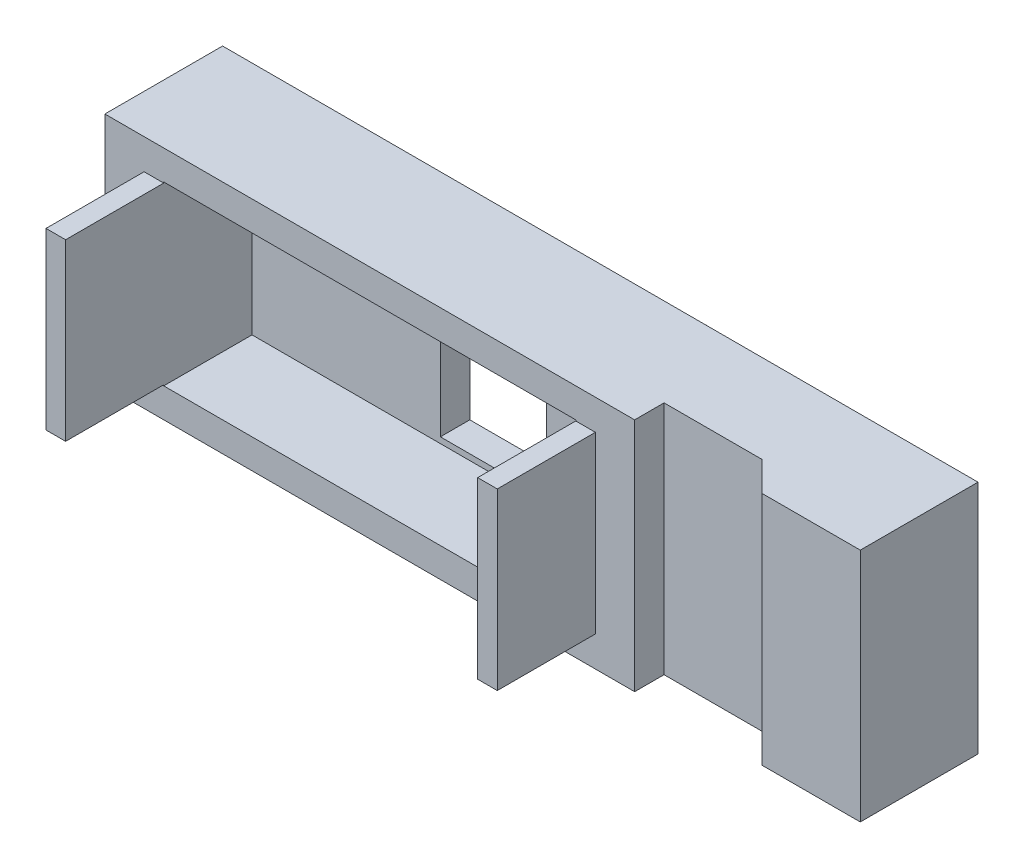
ISO-10303-21;
HEADER;
FILE_DESCRIPTION(('STEP AP214'),'2;1');
FILE_NAME('part.step','',(''),(''),'','','');
FILE_SCHEMA(('AUTOMOTIVE_DESIGN { 1 0 10303 214 1 1 1 1 }'));
ENDSEC;
DATA;
#1=APPLICATION_CONTEXT('core data for automotive mechanical design processes');
#2=APPLICATION_PROTOCOL_DEFINITION('international standard','automotive_design',2000,#1);
#3=PRODUCT_CONTEXT('',#1,'mechanical');
#4=PRODUCT('Part','Part','',(#3));
#5=PRODUCT_RELATED_PRODUCT_CATEGORY('part','',(#4));
#6=PRODUCT_DEFINITION_FORMATION('','',#4);
#7=PRODUCT_DEFINITION_CONTEXT('part definition',#1,'design');
#8=PRODUCT_DEFINITION('design','',#6,#7);
#9=PRODUCT_DEFINITION_SHAPE('','',#8);
#10=(LENGTH_UNIT() NAMED_UNIT(*) SI_UNIT(.MILLI.,.METRE.));
#11=(NAMED_UNIT(*) PLANE_ANGLE_UNIT() SI_UNIT($,.RADIAN.));
#12=(NAMED_UNIT(*) SI_UNIT($,.STERADIAN.) SOLID_ANGLE_UNIT());
#13=UNCERTAINTY_MEASURE_WITH_UNIT(LENGTH_MEASURE(1.E-05),#10,'distance_accuracy_value','');
#14=(GEOMETRIC_REPRESENTATION_CONTEXT(3) GLOBAL_UNCERTAINTY_ASSIGNED_CONTEXT((#13)) GLOBAL_UNIT_ASSIGNED_CONTEXT((#10,
#11,#12)) REPRESENTATION_CONTEXT('',''));
#15=CARTESIAN_POINT('',(0.,0.,0.));
#16=DIRECTION('',(0.,0.,1.));
#17=DIRECTION('',(1.,0.,0.));
#18=AXIS2_PLACEMENT_3D('',#15,#16,#17);
#19=CARTESIAN_POINT('',(0.,0.,6.));
#20=DIRECTION('',(0.,0.,1.));
#21=DIRECTION('',(1.,0.,0.));
#22=AXIS2_PLACEMENT_3D('',#19,#20,#21);
#23=PLANE('',#22);
#24=DIRECTION('',(0.,1.,0.));
#25=VECTOR('',#24,1.);
#26=CARTESIAN_POINT('',(13.5,6.,6.));
#27=LINE('',#26,#25);
#28=CARTESIAN_POINT('',(13.5,-6.,6.));
#29=VERTEX_POINT('',#28);
#30=CARTESIAN_POINT('',(13.5,6.,6.));
#31=VERTEX_POINT('',#30);
#32=EDGE_CURVE('E360',#29,#31,#27,.T.);
#33=ORIENTED_EDGE('',*,*,#32,.T.);
#34=DIRECTION('',(-1.,0.,0.));
#35=VECTOR('',#34,1.);
#36=CARTESIAN_POINT('',(-13.5,6.,6.));
#37=LINE('',#36,#35);
#38=CARTESIAN_POINT('',(-13.5,6.,6.));
#39=VERTEX_POINT('',#38);
#40=EDGE_CURVE('E363',#31,#39,#37,.T.);
#41=ORIENTED_EDGE('',*,*,#40,.T.);
#42=DIRECTION('',(0.,-1.,0.));
#43=VECTOR('',#42,1.);
#44=CARTESIAN_POINT('',(-13.5,6.,6.));
#45=LINE('',#44,#43);
#46=CARTESIAN_POINT('',(-13.5,-6.,6.));
#47=VERTEX_POINT('',#46);
#48=EDGE_CURVE('E366',#39,#47,#45,.T.);
#49=ORIENTED_EDGE('',*,*,#48,.T.);
#50=DIRECTION('',(1.,0.,0.));
#51=VECTOR('',#50,1.);
#52=CARTESIAN_POINT('',(-13.5,-6.,6.));
#53=LINE('',#52,#51);
#54=EDGE_CURVE('E368',#47,#29,#53,.T.);
#55=ORIENTED_EDGE('',*,*,#54,.T.);
#56=EDGE_LOOP('',(#33,#41,#49,#55));
#57=FACE_BOUND('',#56,.T.);
#58=DIRECTION('',(0.,1.,0.));
#59=VECTOR('',#58,1.);
#60=CARTESIAN_POINT('',(11.5,4.45,6.));
#61=LINE('',#60,#59);
#62=CARTESIAN_POINT('',(11.5,-4.45,6.));
#63=VERTEX_POINT('',#62);
#64=CARTESIAN_POINT('',(11.5,4.45,6.));
#65=VERTEX_POINT('',#64);
#66=EDGE_CURVE('E250',#63,#65,#61,.T.);
#67=ORIENTED_EDGE('',*,*,#66,.F.);
#68=DIRECTION('',(1.,0.,0.));
#69=VECTOR('',#68,1.);
#70=CARTESIAN_POINT('',(10.5,-4.45,6.));
#71=LINE('',#70,#69);
#72=CARTESIAN_POINT('',(10.5,-4.45,6.));
#73=VERTEX_POINT('',#72);
#74=EDGE_CURVE('E237',#73,#63,#71,.T.);
#75=ORIENTED_EDGE('',*,*,#74,.F.);
#76=DIRECTION('',(0.,1.,0.));
#77=VECTOR('',#76,1.);
#78=CARTESIAN_POINT('',(10.5,4.5,6.));
#79=LINE('',#78,#77);
#80=CARTESIAN_POINT('',(10.5,-4.5,6.));
#81=VERTEX_POINT('',#80);
#82=EDGE_CURVE('E336',#81,#73,#79,.T.);
#83=ORIENTED_EDGE('',*,*,#82,.F.);
#84=DIRECTION('',(1.,0.,0.));
#85=VECTOR('',#84,1.);
#86=CARTESIAN_POINT('',(-10.5,-4.5,6.));
#87=LINE('',#86,#85);
#88=CARTESIAN_POINT('',(-10.5,-4.5,6.));
#89=VERTEX_POINT('',#88);
#90=EDGE_CURVE('E345',#89,#81,#87,.T.);
#91=ORIENTED_EDGE('',*,*,#90,.F.);
#92=DIRECTION('',(0.,-1.,0.));
#93=VECTOR('',#92,1.);
#94=CARTESIAN_POINT('',(-10.5,4.5,6.));
#95=LINE('',#94,#93);
#96=CARTESIAN_POINT('',(-10.5,-4.45,6.));
#97=VERTEX_POINT('',#96);
#98=EDGE_CURVE('E341',#97,#89,#95,.T.);
#99=ORIENTED_EDGE('',*,*,#98,.F.);
#100=DIRECTION('',(1.,0.,0.));
#101=VECTOR('',#100,1.);
#102=CARTESIAN_POINT('',(-10.5,-4.45,6.));
#103=LINE('',#102,#101);
#104=CARTESIAN_POINT('',(-11.5,-4.45,6.));
#105=VERTEX_POINT('',#104);
#106=EDGE_CURVE('E266',#105,#97,#103,.T.);
#107=ORIENTED_EDGE('',*,*,#106,.F.);
#108=DIRECTION('',(0.,-1.,0.));
#109=VECTOR('',#108,1.);
#110=CARTESIAN_POINT('',(-11.5,4.45,6.));
#111=LINE('',#110,#109);
#112=CARTESIAN_POINT('',(-11.5,4.45,6.));
#113=VERTEX_POINT('',#112);
#114=EDGE_CURVE('E275',#113,#105,#111,.T.);
#115=ORIENTED_EDGE('',*,*,#114,.F.);
#116=DIRECTION('',(-1.,0.,0.));
#117=VECTOR('',#116,1.);
#118=CARTESIAN_POINT('',(-10.5,4.45,6.));
#119=LINE('',#118,#117);
#120=CARTESIAN_POINT('',(-10.5,4.45,6.));
#121=VERTEX_POINT('',#120);
#122=EDGE_CURVE('E261',#121,#113,#119,.T.);
#123=ORIENTED_EDGE('',*,*,#122,.F.);
#124=CARTESIAN_POINT('',(-10.5,4.5,6.));
#125=VERTEX_POINT('',#124);
#126=EDGE_CURVE('E342',#125,#121,#95,.T.);
#127=ORIENTED_EDGE('',*,*,#126,.F.);
#128=DIRECTION('',(-1.,0.,0.));
#129=VECTOR('',#128,1.);
#130=CARTESIAN_POINT('',(-10.5,4.5,6.));
#131=LINE('',#130,#129);
#132=CARTESIAN_POINT('',(10.5,4.5,6.));
#133=VERTEX_POINT('',#132);
#134=EDGE_CURVE('E339',#133,#125,#131,.T.);
#135=ORIENTED_EDGE('',*,*,#134,.F.);
#136=CARTESIAN_POINT('',(10.5,4.45,6.));
#137=VERTEX_POINT('',#136);
#138=EDGE_CURVE('E335',#137,#133,#79,.T.);
#139=ORIENTED_EDGE('',*,*,#138,.F.);
#140=DIRECTION('',(-1.,0.,0.));
#141=VECTOR('',#140,1.);
#142=CARTESIAN_POINT('',(10.5,4.45,6.));
#143=LINE('',#142,#141);
#144=EDGE_CURVE('E242',#65,#137,#143,.T.);
#145=ORIENTED_EDGE('',*,*,#144,.F.);
#146=EDGE_LOOP('',(#67,#75,#83,#91,#99,#107,#115,#123,#127,#135,#139,#145));
#147=FACE_BOUND('',#146,.T.);
#148=ADVANCED_FACE('F33',(#57,#147),#23,.T.);
#149=CARTESIAN_POINT('',(10.5,4.5,6.));
#150=DIRECTION('',(-1.,0.,0.));
#151=DIRECTION('',(0.,0.,1.));
#152=AXIS2_PLACEMENT_3D('',#149,#150,#151);
#153=PLANE('',#152);
#154=DIRECTION('',(0.,0.,-1.));
#155=VECTOR('',#154,1.);
#156=CARTESIAN_POINT('',(10.5,4.5,6.));
#157=LINE('',#156,#155);
#158=CARTESIAN_POINT('',(10.5,4.5,1.5));
#159=VERTEX_POINT('',#158);
#160=EDGE_CURVE('E356',#133,#159,#157,.T.);
#161=ORIENTED_EDGE('',*,*,#160,.T.);
#162=DIRECTION('',(0.,-1.,0.));
#163=VECTOR('',#162,1.);
#164=CARTESIAN_POINT('',(10.5,4.5,1.5));
#165=LINE('',#164,#163);
#166=CARTESIAN_POINT('',(10.5,-4.5,1.5));
#167=VERTEX_POINT('',#166);
#168=EDGE_CURVE('E317',#159,#167,#165,.T.);
#169=ORIENTED_EDGE('',*,*,#168,.T.);
#170=DIRECTION('',(0.,0.,-1.));
#171=VECTOR('',#170,1.);
#172=CARTESIAN_POINT('',(10.5,-4.5,6.));
#173=LINE('',#172,#171);
#174=EDGE_CURVE('E347',#81,#167,#173,.T.);
#175=ORIENTED_EDGE('',*,*,#174,.F.);
#176=ORIENTED_EDGE('',*,*,#82,.T.);
#177=DIRECTION('',(0.,0.,-1.));
#178=VECTOR('',#177,1.);
#179=CARTESIAN_POINT('',(10.5,-4.45,11.));
#180=LINE('',#179,#178);
#181=CARTESIAN_POINT('',(10.5,-4.45,11.));
#182=VERTEX_POINT('',#181);
#183=EDGE_CURVE('E259',#182,#73,#180,.T.);
#184=ORIENTED_EDGE('',*,*,#183,.F.);
#185=DIRECTION('',(0.,-1.,0.));
#186=VECTOR('',#185,1.);
#187=CARTESIAN_POINT('',(10.5,4.45,11.));
#188=LINE('',#187,#186);
#189=CARTESIAN_POINT('',(10.5,4.45,11.));
#190=VERTEX_POINT('',#189);
#191=EDGE_CURVE('E238',#190,#182,#188,.T.);
#192=ORIENTED_EDGE('',*,*,#191,.F.);
#193=DIRECTION('',(0.,0.,-1.));
#194=VECTOR('',#193,1.);
#195=CARTESIAN_POINT('',(10.5,4.45,11.));
#196=LINE('',#195,#194);
#197=EDGE_CURVE('E248',#190,#137,#196,.T.);
#198=ORIENTED_EDGE('',*,*,#197,.T.);
#199=ORIENTED_EDGE('',*,*,#138,.T.);
#200=EDGE_LOOP('',(#161,#169,#175,#176,#184,#192,#198,#199));
#201=FACE_BOUND('',#200,.T.);
#202=ADVANCED_FACE('F439',(#201),#153,.T.);
#203=CARTESIAN_POINT('',(-10.5,4.5,6.));
#204=DIRECTION('',(0.,-1.,0.));
#205=DIRECTION('',(0.,0.,-1.));
#206=AXIS2_PLACEMENT_3D('',#203,#204,#205);
#207=PLANE('',#206);
#208=DIRECTION('',(0.,0.,-1.));
#209=VECTOR('',#208,1.);
#210=CARTESIAN_POINT('',(-10.5,4.5,6.));
#211=LINE('',#210,#209);
#212=CARTESIAN_POINT('',(-10.5,4.5,1.5));
#213=VERTEX_POINT('',#212);
#214=EDGE_CURVE('E353',#125,#213,#211,.T.);
#215=ORIENTED_EDGE('',*,*,#214,.T.);
#216=DIRECTION('',(1.,0.,0.));
#217=VECTOR('',#216,1.);
#218=CARTESIAN_POINT('',(10.5,4.5,1.5));
#219=LINE('',#218,#217);
#220=EDGE_CURVE('E332',#213,#159,#219,.T.);
#221=ORIENTED_EDGE('',*,*,#220,.T.);
#222=ORIENTED_EDGE('',*,*,#160,.F.);
#223=ORIENTED_EDGE('',*,*,#134,.T.);
#224=EDGE_LOOP('',(#215,#221,#222,#223));
#225=FACE_BOUND('',#224,.T.);
#226=ADVANCED_FACE('F436',(#225),#207,.T.);
#227=CARTESIAN_POINT('',(-10.5,4.5,6.));
#228=DIRECTION('',(1.,0.,0.));
#229=DIRECTION('',(0.,0.,-1.));
#230=AXIS2_PLACEMENT_3D('',#227,#228,#229);
#231=PLANE('',#230);
#232=DIRECTION('',(0.,0.,-1.));
#233=VECTOR('',#232,1.);
#234=CARTESIAN_POINT('',(-10.5,-4.5,6.));
#235=LINE('',#234,#233);
#236=CARTESIAN_POINT('',(-10.5,-4.5,1.5));
#237=VERTEX_POINT('',#236);
#238=EDGE_CURVE('E350',#89,#237,#235,.T.);
#239=ORIENTED_EDGE('',*,*,#238,.T.);
#240=DIRECTION('',(0.,1.,0.));
#241=VECTOR('',#240,1.);
#242=CARTESIAN_POINT('',(-10.5,4.5,1.5));
#243=LINE('',#242,#241);
#244=EDGE_CURVE('E329',#237,#213,#243,.T.);
#245=ORIENTED_EDGE('',*,*,#244,.T.);
#246=ORIENTED_EDGE('',*,*,#214,.F.);
#247=ORIENTED_EDGE('',*,*,#126,.T.);
#248=DIRECTION('',(0.,0.,-1.));
#249=VECTOR('',#248,1.);
#250=CARTESIAN_POINT('',(-10.5,4.45,11.));
#251=LINE('',#250,#249);
#252=CARTESIAN_POINT('',(-10.5,4.45,11.));
#253=VERTEX_POINT('',#252);
#254=EDGE_CURVE('E288',#253,#121,#251,.T.);
#255=ORIENTED_EDGE('',*,*,#254,.F.);
#256=DIRECTION('',(0.,1.,0.));
#257=VECTOR('',#256,1.);
#258=CARTESIAN_POINT('',(-10.5,4.45,11.));
#259=LINE('',#258,#257);
#260=CARTESIAN_POINT('',(-10.5,-4.45,11.));
#261=VERTEX_POINT('',#260);
#262=EDGE_CURVE('E262',#261,#253,#259,.T.);
#263=ORIENTED_EDGE('',*,*,#262,.F.);
#264=DIRECTION('',(0.,0.,-1.));
#265=VECTOR('',#264,1.);
#266=CARTESIAN_POINT('',(-10.5,-4.45,11.));
#267=LINE('',#266,#265);
#268=EDGE_CURVE('E272',#261,#97,#267,.T.);
#269=ORIENTED_EDGE('',*,*,#268,.T.);
#270=ORIENTED_EDGE('',*,*,#98,.T.);
#271=EDGE_LOOP('',(#239,#245,#246,#247,#255,#263,#269,#270));
#272=FACE_BOUND('',#271,.T.);
#273=ADVANCED_FACE('F448',(#272),#231,.T.);
#274=CARTESIAN_POINT('',(-10.5,-4.5,6.));
#275=DIRECTION('',(0.,1.,0.));
#276=DIRECTION('',(0.,0.,1.));
#277=AXIS2_PLACEMENT_3D('',#274,#275,#276);
#278=PLANE('',#277);
#279=ORIENTED_EDGE('',*,*,#174,.T.);
#280=DIRECTION('',(-1.,0.,0.));
#281=VECTOR('',#280,1.);
#282=CARTESIAN_POINT('',(10.5,-4.5,1.5));
#283=LINE('',#282,#281);
#284=EDGE_CURVE('E326',#167,#237,#283,.T.);
#285=ORIENTED_EDGE('',*,*,#284,.T.);
#286=ORIENTED_EDGE('',*,*,#238,.F.);
#287=ORIENTED_EDGE('',*,*,#90,.T.);
#288=EDGE_LOOP('',(#279,#285,#286,#287));
#289=FACE_BOUND('',#288,.T.);
#290=ADVANCED_FACE('F409',(#289),#278,.T.);
#291=CARTESIAN_POINT('',(0.,0.,0.));
#292=DIRECTION('',(0.,0.,1.));
#293=DIRECTION('',(1.,0.,0.));
#294=AXIS2_PLACEMENT_3D('',#291,#292,#293);
#295=PLANE('',#294);
#296=CARTESIAN_POINT('',(22.,0.,0.));
#297=DIRECTION('',(0.,0.,-1.));
#298=DIRECTION('',(-1.,0.,0.));
#299=AXIS2_PLACEMENT_3D('',#296,#297,#298);
#300=CIRCLE('',#299,1.55);
#301=CARTESIAN_POINT('',(20.45,0.,0.));
#302=VERTEX_POINT('',#301);
#303=EDGE_CURVE('E218',#302,#302,#300,.T.);
#304=ORIENTED_EDGE('',*,*,#303,.F.);
#305=EDGE_LOOP('',(#304));
#306=FACE_BOUND('',#305,.T.);
#307=DIRECTION('',(-1.,0.,0.));
#308=VECTOR('',#307,1.);
#309=CARTESIAN_POINT('',(-0.900000000000001,4.,0.));
#310=LINE('',#309,#308);
#311=CARTESIAN_POINT('',(4.5,4.,0.));
#312=VERTEX_POINT('',#311);
#313=CARTESIAN_POINT('',(-0.900000000000001,4.,0.));
#314=VERTEX_POINT('',#313);
#315=EDGE_CURVE('E302',#312,#314,#310,.T.);
#316=ORIENTED_EDGE('',*,*,#315,.T.);
#317=DIRECTION('',(0.,-1.,0.));
#318=VECTOR('',#317,1.);
#319=CARTESIAN_POINT('',(-0.900000000000001,4.,0.));
#320=LINE('',#319,#318);
#321=CARTESIAN_POINT('',(-0.9,-4.2,0.));
#322=VERTEX_POINT('',#321);
#323=EDGE_CURVE('E292',#314,#322,#320,.T.);
#324=ORIENTED_EDGE('',*,*,#323,.T.);
#325=DIRECTION('',(1.,0.,0.));
#326=VECTOR('',#325,1.);
#327=CARTESIAN_POINT('',(-0.9,-4.2,0.));
#328=LINE('',#327,#326);
#329=CARTESIAN_POINT('',(4.5,-4.2,0.));
#330=VERTEX_POINT('',#329);
#331=EDGE_CURVE('E295',#322,#330,#328,.T.);
#332=ORIENTED_EDGE('',*,*,#331,.T.);
#333=DIRECTION('',(0.,1.,0.));
#334=VECTOR('',#333,1.);
#335=CARTESIAN_POINT('',(4.5,4.,0.));
#336=LINE('',#335,#334);
#337=EDGE_CURVE('E299',#330,#312,#336,.T.);
#338=ORIENTED_EDGE('',*,*,#337,.T.);
#339=EDGE_LOOP('',(#316,#324,#332,#338));
#340=FACE_BOUND('',#339,.T.);
#341=DIRECTION('',(-1.,0.,0.));
#342=VECTOR('',#341,1.);
#343=CARTESIAN_POINT('',(-13.5,6.,0.));
#344=LINE('',#343,#342);
#345=CARTESIAN_POINT('',(25.,6.,0.));
#346=VERTEX_POINT('',#345);
#347=CARTESIAN_POINT('',(-13.5,6.,0.));
#348=VERTEX_POINT('',#347);
#349=EDGE_CURVE('E359',#346,#348,#344,.T.);
#350=ORIENTED_EDGE('',*,*,#349,.F.);
#351=DIRECTION('',(0.,1.,0.));
#352=VECTOR('',#351,1.);
#353=CARTESIAN_POINT('',(25.,-18.9711217710729,0.));
#354=LINE('',#353,#352);
#355=CARTESIAN_POINT('',(25.,-6.,0.));
#356=VERTEX_POINT('',#355);
#357=EDGE_CURVE('E228',#356,#346,#354,.T.);
#358=ORIENTED_EDGE('',*,*,#357,.F.);
#359=DIRECTION('',(1.,0.,0.));
#360=VECTOR('',#359,1.);
#361=CARTESIAN_POINT('',(-13.5,-6.,0.));
#362=LINE('',#361,#360);
#363=CARTESIAN_POINT('',(-13.5,-6.,0.));
#364=VERTEX_POINT('',#363);
#365=EDGE_CURVE('E364',#364,#356,#362,.T.);
#366=ORIENTED_EDGE('',*,*,#365,.F.);
#367=DIRECTION('',(0.,-1.,0.));
#368=VECTOR('',#367,1.);
#369=CARTESIAN_POINT('',(-13.5,6.,0.));
#370=LINE('',#369,#368);
#371=EDGE_CURVE('E372',#348,#364,#370,.T.);
#372=ORIENTED_EDGE('',*,*,#371,.F.);
#373=EDGE_LOOP('',(#350,#358,#366,#372));
#374=FACE_BOUND('',#373,.T.);
#375=ADVANCED_FACE('F388',(#306,#340,#374),#295,.F.);
#376=CARTESIAN_POINT('',(13.5,6.,6.));
#377=DIRECTION('',(-1.,0.,0.));
#378=DIRECTION('',(0.,-1.,0.));
#379=AXIS2_PLACEMENT_3D('',#376,#377,#378);
#380=PLANE('',#379);
#381=DIRECTION('',(0.,0.,-1.));
#382=VECTOR('',#381,1.);
#383=CARTESIAN_POINT('',(13.5,-6.,6.));
#384=LINE('',#383,#382);
#385=CARTESIAN_POINT('',(13.5,-6.,4.5));
#386=VERTEX_POINT('',#385);
#387=EDGE_CURVE('E370',#29,#386,#384,.T.);
#388=ORIENTED_EDGE('',*,*,#387,.T.);
#389=DIRECTION('',(0.,1.,0.));
#390=VECTOR('',#389,1.);
#391=CARTESIAN_POINT('',(13.5,-18.9711217710729,4.5));
#392=LINE('',#391,#390);
#393=CARTESIAN_POINT('',(13.5,6.,4.5));
#394=VERTEX_POINT('',#393);
#395=EDGE_CURVE('E202',#386,#394,#392,.T.);
#396=ORIENTED_EDGE('',*,*,#395,.T.);
#397=DIRECTION('',(0.,0.,-1.));
#398=VECTOR('',#397,1.);
#399=CARTESIAN_POINT('',(13.5,6.,6.));
#400=LINE('',#399,#398);
#401=EDGE_CURVE('E11',#31,#394,#400,.T.);
#402=ORIENTED_EDGE('',*,*,#401,.F.);
#403=ORIENTED_EDGE('',*,*,#32,.F.);
#404=EDGE_LOOP('',(#388,#396,#402,#403));
#405=FACE_BOUND('',#404,.T.);
#406=ADVANCED_FACE('F35',(#405),#380,.F.);
#407=CARTESIAN_POINT('',(-13.5,6.,6.));
#408=DIRECTION('',(0.,-1.,0.));
#409=DIRECTION('',(1.,0.,0.));
#410=AXIS2_PLACEMENT_3D('',#407,#408,#409);
#411=PLANE('',#410);
#412=ORIENTED_EDGE('',*,*,#349,.T.);
#413=DIRECTION('',(0.,0.,-1.));
#414=VECTOR('',#413,1.);
#415=CARTESIAN_POINT('',(-13.5,6.,6.));
#416=LINE('',#415,#414);
#417=EDGE_CURVE('E41',#39,#348,#416,.T.);
#418=ORIENTED_EDGE('',*,*,#417,.F.);
#419=ORIENTED_EDGE('',*,*,#40,.F.);
#420=ORIENTED_EDGE('',*,*,#401,.T.);
#421=DIRECTION('',(1.,0.,0.));
#422=VECTOR('',#421,1.);
#423=CARTESIAN_POINT('',(13.5,6.,4.5));
#424=LINE('',#423,#422);
#425=CARTESIAN_POINT('',(18.5,6.,4.5));
#426=VERTEX_POINT('',#425);
#427=EDGE_CURVE('E48',#394,#426,#424,.T.);
#428=ORIENTED_EDGE('',*,*,#427,.T.);
#429=DIRECTION('',(0.707106781186548,0.,0.707106781186547));
#430=VECTOR('',#429,1.);
#431=CARTESIAN_POINT('',(18.5,6.,4.5));
#432=LINE('',#431,#430);
#433=CARTESIAN_POINT('',(20.,6.,6.));
#434=VERTEX_POINT('',#433);
#435=EDGE_CURVE('E205',#426,#434,#432,.T.);
#436=ORIENTED_EDGE('',*,*,#435,.T.);
#437=DIRECTION('',(1.,0.,0.));
#438=VECTOR('',#437,1.);
#439=CARTESIAN_POINT('',(20.,6.,6.));
#440=LINE('',#439,#438);
#441=CARTESIAN_POINT('',(25.,6.,6.));
#442=VERTEX_POINT('',#441);
#443=EDGE_CURVE('E211',#434,#442,#440,.T.);
#444=ORIENTED_EDGE('',*,*,#443,.T.);
#445=DIRECTION('',(0.,0.,-1.));
#446=VECTOR('',#445,1.);
#447=CARTESIAN_POINT('',(25.,6.,6.));
#448=LINE('',#447,#446);
#449=EDGE_CURVE('E225',#442,#346,#448,.T.);
#450=ORIENTED_EDGE('',*,*,#449,.T.);
#451=EDGE_LOOP('',(#412,#418,#419,#420,#428,#436,#444,#450));
#452=FACE_BOUND('',#451,.T.);
#453=ADVANCED_FACE('F213',(#452),#411,.F.);
#454=CARTESIAN_POINT('',(-13.5,6.,6.));
#455=DIRECTION('',(1.,0.,0.));
#456=DIRECTION('',(0.,0.,-1.));
#457=AXIS2_PLACEMENT_3D('',#454,#455,#456);
#458=PLANE('',#457);
#459=ORIENTED_EDGE('',*,*,#371,.T.);
#460=DIRECTION('',(0.,0.,-1.));
#461=VECTOR('',#460,1.);
#462=CARTESIAN_POINT('',(-13.5,-6.,6.));
#463=LINE('',#462,#461);
#464=EDGE_CURVE('E377',#47,#364,#463,.T.);
#465=ORIENTED_EDGE('',*,*,#464,.F.);
#466=ORIENTED_EDGE('',*,*,#48,.F.);
#467=ORIENTED_EDGE('',*,*,#417,.T.);
#468=EDGE_LOOP('',(#459,#465,#466,#467));
#469=FACE_BOUND('',#468,.T.);
#470=ADVANCED_FACE('F384',(#469),#458,.F.);
#471=CARTESIAN_POINT('',(-13.5,-6.,6.));
#472=DIRECTION('',(0.,1.,0.));
#473=DIRECTION('',(0.,0.,1.));
#474=AXIS2_PLACEMENT_3D('',#471,#472,#473);
#475=PLANE('',#474);
#476=ORIENTED_EDGE('',*,*,#365,.T.);
#477=DIRECTION('',(0.,0.,1.));
#478=VECTOR('',#477,1.);
#479=CARTESIAN_POINT('',(25.,-6.,6.));
#480=LINE('',#479,#478);
#481=CARTESIAN_POINT('',(25.,-6.,6.));
#482=VERTEX_POINT('',#481);
#483=EDGE_CURVE('E221',#356,#482,#480,.T.);
#484=ORIENTED_EDGE('',*,*,#483,.T.);
#485=DIRECTION('',(-1.,0.,0.));
#486=VECTOR('',#485,1.);
#487=CARTESIAN_POINT('',(20.,-6.,6.));
#488=LINE('',#487,#486);
#489=CARTESIAN_POINT('',(20.,-6.,6.));
#490=VERTEX_POINT('',#489);
#491=EDGE_CURVE('E399',#482,#490,#488,.T.);
#492=ORIENTED_EDGE('',*,*,#491,.T.);
#493=DIRECTION('',(-0.707106781186548,0.,-0.707106781186547));
#494=VECTOR('',#493,1.);
#495=CARTESIAN_POINT('',(18.5,-6.,4.5));
#496=LINE('',#495,#494);
#497=CARTESIAN_POINT('',(18.5,-6.,4.5));
#498=VERTEX_POINT('',#497);
#499=EDGE_CURVE('E231',#490,#498,#496,.T.);
#500=ORIENTED_EDGE('',*,*,#499,.T.);
#501=DIRECTION('',(-1.,0.,0.));
#502=VECTOR('',#501,1.);
#503=CARTESIAN_POINT('',(13.5,-6.,4.5));
#504=LINE('',#503,#502);
#505=EDGE_CURVE('E198',#498,#386,#504,.T.);
#506=ORIENTED_EDGE('',*,*,#505,.T.);
#507=ORIENTED_EDGE('',*,*,#387,.F.);
#508=ORIENTED_EDGE('',*,*,#54,.F.);
#509=ORIENTED_EDGE('',*,*,#464,.T.);
#510=EDGE_LOOP('',(#476,#484,#492,#500,#506,#507,#508,#509));
#511=FACE_BOUND('',#510,.T.);
#512=ADVANCED_FACE('F392',(#511),#475,.F.);
#513=CARTESIAN_POINT('',(0.,0.,1.5));
#514=DIRECTION('',(0.,0.,-1.));
#515=DIRECTION('',(-1.,0.,0.));
#516=AXIS2_PLACEMENT_3D('',#513,#514,#515);
#517=PLANE('',#516);
#518=DIRECTION('',(1.,0.,0.));
#519=VECTOR('',#518,1.);
#520=CARTESIAN_POINT('',(-0.9,-4.2,1.5));
#521=LINE('',#520,#519);
#522=CARTESIAN_POINT('',(-0.9,-4.2,1.5));
#523=VERTEX_POINT('',#522);
#524=CARTESIAN_POINT('',(4.5,-4.2,1.5));
#525=VERTEX_POINT('',#524);
#526=EDGE_CURVE('E307',#523,#525,#521,.T.);
#527=ORIENTED_EDGE('',*,*,#526,.F.);
#528=DIRECTION('',(0.,-1.,0.));
#529=VECTOR('',#528,1.);
#530=CARTESIAN_POINT('',(-0.900000000000001,4.,1.5));
#531=LINE('',#530,#529);
#532=CARTESIAN_POINT('',(-0.900000000000001,4.,1.5));
#533=VERTEX_POINT('',#532);
#534=EDGE_CURVE('E291',#533,#523,#531,.T.);
#535=ORIENTED_EDGE('',*,*,#534,.F.);
#536=DIRECTION('',(-1.,0.,0.));
#537=VECTOR('',#536,1.);
#538=CARTESIAN_POINT('',(-0.900000000000001,4.,1.5));
#539=LINE('',#538,#537);
#540=CARTESIAN_POINT('',(4.5,4.,1.5));
#541=VERTEX_POINT('',#540);
#542=EDGE_CURVE('E296',#541,#533,#539,.T.);
#543=ORIENTED_EDGE('',*,*,#542,.F.);
#544=DIRECTION('',(0.,1.,0.));
#545=VECTOR('',#544,1.);
#546=CARTESIAN_POINT('',(4.5,4.,1.5));
#547=LINE('',#546,#545);
#548=EDGE_CURVE('E310',#525,#541,#547,.T.);
#549=ORIENTED_EDGE('',*,*,#548,.F.);
#550=EDGE_LOOP('',(#527,#535,#543,#549));
#551=FACE_BOUND('',#550,.T.);
#552=ORIENTED_EDGE('',*,*,#168,.F.);
#553=ORIENTED_EDGE('',*,*,#220,.F.);
#554=ORIENTED_EDGE('',*,*,#244,.F.);
#555=ORIENTED_EDGE('',*,*,#284,.F.);
#556=EDGE_LOOP('',(#552,#553,#554,#555));
#557=FACE_BOUND('',#556,.T.);
#558=ADVANCED_FACE('F428',(#551,#557),#517,.F.);
#559=CARTESIAN_POINT('',(-0.900000000000001,4.,0.));
#560=DIRECTION('',(-1.,0.,0.));
#561=DIRECTION('',(0.,-1.,0.));
#562=AXIS2_PLACEMENT_3D('',#559,#560,#561);
#563=PLANE('',#562);
#564=ORIENTED_EDGE('',*,*,#534,.T.);
#565=DIRECTION('',(0.,0.,1.));
#566=VECTOR('',#565,1.);
#567=CARTESIAN_POINT('',(-0.9,-4.2,0.));
#568=LINE('',#567,#566);
#569=EDGE_CURVE('E305',#322,#523,#568,.T.);
#570=ORIENTED_EDGE('',*,*,#569,.F.);
#571=ORIENTED_EDGE('',*,*,#323,.F.);
#572=DIRECTION('',(0.,0.,1.));
#573=VECTOR('',#572,1.);
#574=CARTESIAN_POINT('',(-0.900000000000001,4.,0.));
#575=LINE('',#574,#573);
#576=EDGE_CURVE('E315',#314,#533,#575,.T.);
#577=ORIENTED_EDGE('',*,*,#576,.T.);
#578=EDGE_LOOP('',(#564,#570,#571,#577));
#579=FACE_BOUND('',#578,.T.);
#580=ADVANCED_FACE('F418',(#579),#563,.F.);
#581=CARTESIAN_POINT('',(-0.900000000000001,4.,0.));
#582=DIRECTION('',(0.,1.,0.));
#583=DIRECTION('',(0.,0.,1.));
#584=AXIS2_PLACEMENT_3D('',#581,#582,#583);
#585=PLANE('',#584);
#586=ORIENTED_EDGE('',*,*,#542,.T.);
#587=ORIENTED_EDGE('',*,*,#576,.F.);
#588=ORIENTED_EDGE('',*,*,#315,.F.);
#589=DIRECTION('',(0.,0.,1.));
#590=VECTOR('',#589,1.);
#591=CARTESIAN_POINT('',(4.5,4.,0.));
#592=LINE('',#591,#590);
#593=EDGE_CURVE('E318',#312,#541,#592,.T.);
#594=ORIENTED_EDGE('',*,*,#593,.T.);
#595=EDGE_LOOP('',(#586,#587,#588,#594));
#596=FACE_BOUND('',#595,.T.);
#597=ADVANCED_FACE('F414',(#596),#585,.F.);
#598=CARTESIAN_POINT('',(4.5,4.,0.));
#599=DIRECTION('',(1.,0.,0.));
#600=DIRECTION('',(0.,1.,0.));
#601=AXIS2_PLACEMENT_3D('',#598,#599,#600);
#602=PLANE('',#601);
#603=ORIENTED_EDGE('',*,*,#548,.T.);
#604=ORIENTED_EDGE('',*,*,#593,.F.);
#605=ORIENTED_EDGE('',*,*,#337,.F.);
#606=DIRECTION('',(0.,0.,1.));
#607=VECTOR('',#606,1.);
#608=CARTESIAN_POINT('',(4.5,-4.2,0.));
#609=LINE('',#608,#607);
#610=EDGE_CURVE('E320',#330,#525,#609,.T.);
#611=ORIENTED_EDGE('',*,*,#610,.T.);
#612=EDGE_LOOP('',(#603,#604,#605,#611));
#613=FACE_BOUND('',#612,.T.);
#614=ADVANCED_FACE('F426',(#613),#602,.F.);
#615=CARTESIAN_POINT('',(-0.9,-4.2,0.));
#616=DIRECTION('',(0.,-1.,0.));
#617=DIRECTION('',(0.,0.,-1.));
#618=AXIS2_PLACEMENT_3D('',#615,#616,#617);
#619=PLANE('',#618);
#620=ORIENTED_EDGE('',*,*,#526,.T.);
#621=ORIENTED_EDGE('',*,*,#610,.F.);
#622=ORIENTED_EDGE('',*,*,#331,.F.);
#623=ORIENTED_EDGE('',*,*,#569,.T.);
#624=EDGE_LOOP('',(#620,#621,#622,#623));
#625=FACE_BOUND('',#624,.T.);
#626=ADVANCED_FACE('F423',(#625),#619,.F.);
#627=CARTESIAN_POINT('',(-10.5,4.45,11.));
#628=DIRECTION('',(0.,-1.,0.));
#629=DIRECTION('',(0.,0.,-1.));
#630=AXIS2_PLACEMENT_3D('',#627,#628,#629);
#631=PLANE('',#630);
#632=ORIENTED_EDGE('',*,*,#122,.T.);
#633=DIRECTION('',(0.,0.,-1.));
#634=VECTOR('',#633,1.);
#635=CARTESIAN_POINT('',(-11.5,4.45,11.));
#636=LINE('',#635,#634);
#637=CARTESIAN_POINT('',(-11.5,4.45,11.));
#638=VERTEX_POINT('',#637);
#639=EDGE_CURVE('E285',#638,#113,#636,.T.);
#640=ORIENTED_EDGE('',*,*,#639,.F.);
#641=DIRECTION('',(-1.,0.,0.));
#642=VECTOR('',#641,1.);
#643=CARTESIAN_POINT('',(-10.5,4.45,11.));
#644=LINE('',#643,#642);
#645=EDGE_CURVE('E265',#253,#638,#644,.T.);
#646=ORIENTED_EDGE('',*,*,#645,.F.);
#647=ORIENTED_EDGE('',*,*,#254,.T.);
#648=EDGE_LOOP('',(#632,#640,#646,#647));
#649=FACE_BOUND('',#648,.T.);
#650=ADVANCED_FACE('F623',(#649),#631,.F.);
#651=CARTESIAN_POINT('',(-11.5,4.45,11.));
#652=DIRECTION('',(1.,0.,0.));
#653=DIRECTION('',(0.,1.,0.));
#654=AXIS2_PLACEMENT_3D('',#651,#652,#653);
#655=PLANE('',#654);
#656=ORIENTED_EDGE('',*,*,#114,.T.);
#657=DIRECTION('',(0.,0.,-1.));
#658=VECTOR('',#657,1.);
#659=CARTESIAN_POINT('',(-11.5,-4.45,11.));
#660=LINE('',#659,#658);
#661=CARTESIAN_POINT('',(-11.5,-4.45,11.));
#662=VERTEX_POINT('',#661);
#663=EDGE_CURVE('E282',#662,#105,#660,.T.);
#664=ORIENTED_EDGE('',*,*,#663,.F.);
#665=DIRECTION('',(0.,-1.,0.));
#666=VECTOR('',#665,1.);
#667=CARTESIAN_POINT('',(-11.5,4.45,11.));
#668=LINE('',#667,#666);
#669=EDGE_CURVE('E268',#638,#662,#668,.T.);
#670=ORIENTED_EDGE('',*,*,#669,.F.);
#671=ORIENTED_EDGE('',*,*,#639,.T.);
#672=EDGE_LOOP('',(#656,#664,#670,#671));
#673=FACE_BOUND('',#672,.T.);
#674=ADVANCED_FACE('F613',(#673),#655,.F.);
#675=CARTESIAN_POINT('',(-10.5,-4.45,11.));
#676=DIRECTION('',(0.,1.,0.));
#677=DIRECTION('',(-1.,0.,0.));
#678=AXIS2_PLACEMENT_3D('',#675,#676,#677);
#679=PLANE('',#678);
#680=ORIENTED_EDGE('',*,*,#106,.T.);
#681=ORIENTED_EDGE('',*,*,#268,.F.);
#682=DIRECTION('',(1.,0.,0.));
#683=VECTOR('',#682,1.);
#684=CARTESIAN_POINT('',(-10.5,-4.45,11.));
#685=LINE('',#684,#683);
#686=EDGE_CURVE('E270',#662,#261,#685,.T.);
#687=ORIENTED_EDGE('',*,*,#686,.F.);
#688=ORIENTED_EDGE('',*,*,#663,.T.);
#689=EDGE_LOOP('',(#680,#681,#687,#688));
#690=FACE_BOUND('',#689,.T.);
#691=ADVANCED_FACE('F603',(#690),#679,.F.);
#692=CARTESIAN_POINT('',(0.,0.,11.));
#693=DIRECTION('',(0.,0.,-1.));
#694=DIRECTION('',(-1.,0.,0.));
#695=AXIS2_PLACEMENT_3D('',#692,#693,#694);
#696=PLANE('',#695);
#697=ORIENTED_EDGE('',*,*,#262,.T.);
#698=ORIENTED_EDGE('',*,*,#645,.T.);
#699=ORIENTED_EDGE('',*,*,#669,.T.);
#700=ORIENTED_EDGE('',*,*,#686,.T.);
#701=EDGE_LOOP('',(#697,#698,#699,#700));
#702=FACE_BOUND('',#701,.T.);
#703=ADVANCED_FACE('F594',(#702),#696,.F.);
#704=CARTESIAN_POINT('',(10.5,-4.45,11.));
#705=DIRECTION('',(0.,1.,0.));
#706=DIRECTION('',(-1.,0.,0.));
#707=AXIS2_PLACEMENT_3D('',#704,#705,#706);
#708=PLANE('',#707);
#709=ORIENTED_EDGE('',*,*,#74,.T.);
#710=DIRECTION('',(0.,0.,-1.));
#711=VECTOR('',#710,1.);
#712=CARTESIAN_POINT('',(11.5,-4.45,11.));
#713=LINE('',#712,#711);
#714=CARTESIAN_POINT('',(11.5,-4.45,11.));
#715=VERTEX_POINT('',#714);
#716=EDGE_CURVE('E256',#715,#63,#713,.T.);
#717=ORIENTED_EDGE('',*,*,#716,.F.);
#718=DIRECTION('',(1.,0.,0.));
#719=VECTOR('',#718,1.);
#720=CARTESIAN_POINT('',(10.5,-4.45,11.));
#721=LINE('',#720,#719);
#722=EDGE_CURVE('E241',#182,#715,#721,.T.);
#723=ORIENTED_EDGE('',*,*,#722,.F.);
#724=ORIENTED_EDGE('',*,*,#183,.T.);
#725=EDGE_LOOP('',(#709,#717,#723,#724));
#726=FACE_BOUND('',#725,.T.);
#727=ADVANCED_FACE('F458',(#726),#708,.F.);
#728=CARTESIAN_POINT('',(11.5,4.45,11.));
#729=DIRECTION('',(-1.,0.,0.));
#730=DIRECTION('',(0.,-1.,0.));
#731=AXIS2_PLACEMENT_3D('',#728,#729,#730);
#732=PLANE('',#731);
#733=ORIENTED_EDGE('',*,*,#66,.T.);
#734=DIRECTION('',(0.,0.,-1.));
#735=VECTOR('',#734,1.);
#736=CARTESIAN_POINT('',(11.5,4.45,11.));
#737=LINE('',#736,#735);
#738=CARTESIAN_POINT('',(11.5,4.45,11.));
#739=VERTEX_POINT('',#738);
#740=EDGE_CURVE('E56',#739,#65,#737,.T.);
#741=ORIENTED_EDGE('',*,*,#740,.F.);
#742=DIRECTION('',(0.,1.,0.));
#743=VECTOR('',#742,1.);
#744=CARTESIAN_POINT('',(11.5,4.45,11.));
#745=LINE('',#744,#743);
#746=EDGE_CURVE('E244',#715,#739,#745,.T.);
#747=ORIENTED_EDGE('',*,*,#746,.F.);
#748=ORIENTED_EDGE('',*,*,#716,.T.);
#749=EDGE_LOOP('',(#733,#741,#747,#748));
#750=FACE_BOUND('',#749,.T.);
#751=ADVANCED_FACE('F461',(#750),#732,.F.);
#752=CARTESIAN_POINT('',(10.5,4.45,11.));
#753=DIRECTION('',(0.,-1.,0.));
#754=DIRECTION('',(0.,0.,-1.));
#755=AXIS2_PLACEMENT_3D('',#752,#753,#754);
#756=PLANE('',#755);
#757=ORIENTED_EDGE('',*,*,#144,.T.);
#758=ORIENTED_EDGE('',*,*,#197,.F.);
#759=DIRECTION('',(-1.,0.,0.));
#760=VECTOR('',#759,1.);
#761=CARTESIAN_POINT('',(10.5,4.45,11.));
#762=LINE('',#761,#760);
#763=EDGE_CURVE('E246',#739,#190,#762,.T.);
#764=ORIENTED_EDGE('',*,*,#763,.F.);
#765=ORIENTED_EDGE('',*,*,#740,.T.);
#766=EDGE_LOOP('',(#757,#758,#764,#765));
#767=FACE_BOUND('',#766,.T.);
#768=ADVANCED_FACE('F464',(#767),#756,.F.);
#769=CARTESIAN_POINT('',(0.,0.,11.));
#770=DIRECTION('',(0.,0.,1.));
#771=DIRECTION('',(1.,0.,0.));
#772=AXIS2_PLACEMENT_3D('',#769,#770,#771);
#773=PLANE('',#772);
#774=ORIENTED_EDGE('',*,*,#191,.T.);
#775=ORIENTED_EDGE('',*,*,#722,.T.);
#776=ORIENTED_EDGE('',*,*,#746,.T.);
#777=ORIENTED_EDGE('',*,*,#763,.T.);
#778=EDGE_LOOP('',(#774,#775,#776,#777));
#779=FACE_BOUND('',#778,.T.);
#780=ADVANCED_FACE('F463',(#779),#773,.T.);
#781=CARTESIAN_POINT('',(25.,-18.9711217710729,6.));
#782=DIRECTION('',(1.,0.,0.));
#783=DIRECTION('',(0.,1.,0.));
#784=AXIS2_PLACEMENT_3D('',#781,#782,#783);
#785=PLANE('',#784);
#786=ORIENTED_EDGE('',*,*,#483,.F.);
#787=ORIENTED_EDGE('',*,*,#357,.T.);
#788=ORIENTED_EDGE('',*,*,#449,.F.);
#789=DIRECTION('',(0.,1.,0.));
#790=VECTOR('',#789,1.);
#791=CARTESIAN_POINT('',(25.,-18.9711217710729,6.));
#792=LINE('',#791,#790);
#793=EDGE_CURVE('E232',#482,#442,#792,.T.);
#794=ORIENTED_EDGE('',*,*,#793,.F.);
#795=EDGE_LOOP('',(#786,#787,#788,#794));
#796=FACE_BOUND('',#795,.T.);
#797=ADVANCED_FACE('F397',(#796),#785,.T.);
#798=CARTESIAN_POINT('',(20.,-18.9711217710729,6.));
#799=DIRECTION('',(0.,0.,1.));
#800=DIRECTION('',(1.,0.,0.));
#801=AXIS2_PLACEMENT_3D('',#798,#799,#800);
#802=PLANE('',#801);
#803=ORIENTED_EDGE('',*,*,#491,.F.);
#804=ORIENTED_EDGE('',*,*,#793,.T.);
#805=ORIENTED_EDGE('',*,*,#443,.F.);
#806=DIRECTION('',(0.,1.,0.));
#807=VECTOR('',#806,1.);
#808=CARTESIAN_POINT('',(20.,-18.9711217710729,6.));
#809=LINE('',#808,#807);
#810=EDGE_CURVE('E201',#490,#434,#809,.T.);
#811=ORIENTED_EDGE('',*,*,#810,.F.);
#812=EDGE_LOOP('',(#803,#804,#805,#811));
#813=FACE_BOUND('',#812,.T.);
#814=ADVANCED_FACE('F495',(#813),#802,.T.);
#815=CARTESIAN_POINT('',(18.5,-18.9711217710729,4.5));
#816=DIRECTION('',(-0.707106781186547,0.,0.707106781186548));
#817=DIRECTION('',(0.707106781186548,0.,0.707106781186547));
#818=AXIS2_PLACEMENT_3D('',#815,#816,#817);
#819=PLANE('',#818);
#820=ORIENTED_EDGE('',*,*,#499,.F.);
#821=ORIENTED_EDGE('',*,*,#810,.T.);
#822=ORIENTED_EDGE('',*,*,#435,.F.);
#823=DIRECTION('',(0.,1.,0.));
#824=VECTOR('',#823,1.);
#825=CARTESIAN_POINT('',(18.5,-18.9711217710729,4.5));
#826=LINE('',#825,#824);
#827=EDGE_CURVE('E195',#498,#426,#826,.T.);
#828=ORIENTED_EDGE('',*,*,#827,.F.);
#829=EDGE_LOOP('',(#820,#821,#822,#828));
#830=FACE_BOUND('',#829,.T.);
#831=ADVANCED_FACE('F206',(#830),#819,.T.);
#832=CARTESIAN_POINT('',(13.5,-18.9711217710729,4.5));
#833=DIRECTION('',(0.,0.,1.));
#834=DIRECTION('',(1.,0.,0.));
#835=AXIS2_PLACEMENT_3D('',#832,#833,#834);
#836=PLANE('',#835);
#837=ORIENTED_EDGE('',*,*,#505,.F.);
#838=ORIENTED_EDGE('',*,*,#827,.T.);
#839=ORIENTED_EDGE('',*,*,#427,.F.);
#840=ORIENTED_EDGE('',*,*,#395,.F.);
#841=EDGE_LOOP('',(#837,#838,#839,#840));
#842=FACE_BOUND('',#841,.T.);
#843=ADVANCED_FACE('F197',(#842),#836,.T.);
#844=CARTESIAN_POINT('',(22.,0.,3.5));
#845=DIRECTION('',(0.,0.,-1.));
#846=DIRECTION('',(-1.,0.,0.));
#847=AXIS2_PLACEMENT_3D('',#844,#845,#846);
#848=CYLINDRICAL_SURFACE('',#847,1.55);
#849=CARTESIAN_POINT('',(22.,0.,3.5));
#850=DIRECTION('',(0.,0.,-1.));
#851=DIRECTION('',(-1.,0.,0.));
#852=AXIS2_PLACEMENT_3D('',#849,#850,#851);
#853=CIRCLE('',#852,1.55);
#854=CARTESIAN_POINT('',(20.45,0.,3.5));
#855=VERTEX_POINT('',#854);
#856=EDGE_CURVE('E215',#855,#855,#853,.T.);
#857=ORIENTED_EDGE('',*,*,#856,.F.);
#858=EDGE_LOOP('',(#857));
#859=FACE_BOUND('',#858,.T.);
#860=ORIENTED_EDGE('',*,*,#303,.T.);
#861=EDGE_LOOP('',(#860));
#862=FACE_BOUND('',#861,.T.);
#863=ADVANCED_FACE('F405',(#859,#862),#848,.F.);
#864=CARTESIAN_POINT('',(22.,0.,3.5));
#865=DIRECTION('',(0.,0.,-1.));
#866=DIRECTION('',(-1.,0.,0.));
#867=AXIS2_PLACEMENT_3D('',#864,#865,#866);
#868=PLANE('',#867);
#869=ORIENTED_EDGE('',*,*,#856,.T.);
#870=EDGE_LOOP('',(#869));
#871=FACE_BOUND('',#870,.T.);
#872=ADVANCED_FACE('F510',(#871),#868,.T.);
#873=CLOSED_SHELL('',(#148,#202,#226,#273,#290,#375,#406,#453,#470,#512,#558,#580,#597,#614,
#626,#650,#674,#691,#703,#727,#751,#768,#780,#797,#814,#831,#843,#863,#872));
#874=MANIFOLD_SOLID_BREP('B2',#873);
#875=ADVANCED_BREP_SHAPE_REPRESENTATION('',(#18,#874),#14);
#876=SHAPE_DEFINITION_REPRESENTATION(#9,#875);
ENDSEC;
END-ISO-10303-21;
